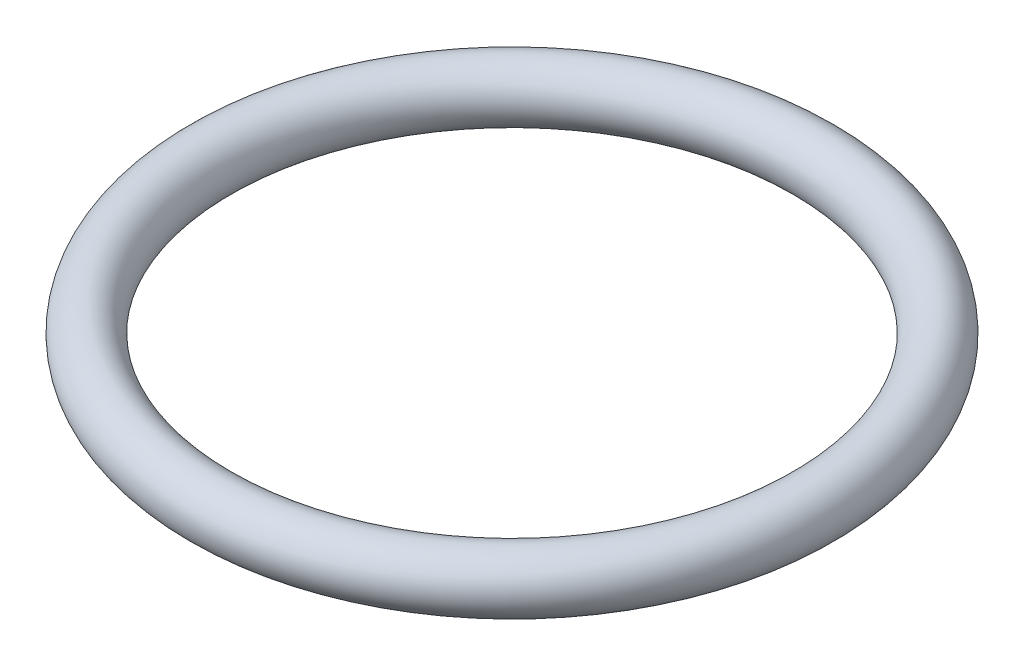
ISO-10303-21;
HEADER;
FILE_DESCRIPTION(('STEP AP214'),'2;1');
FILE_NAME('part.step','',(''),(''),'','','');
FILE_SCHEMA(('AUTOMOTIVE_DESIGN { 1 0 10303 214 1 1 1 1 }'));
ENDSEC;
DATA;
#1=APPLICATION_CONTEXT('core data for automotive mechanical design processes');
#2=APPLICATION_PROTOCOL_DEFINITION('international standard','automotive_design',2000,#1);
#3=PRODUCT_CONTEXT('',#1,'mechanical');
#4=PRODUCT('Part','Part','',(#3));
#5=PRODUCT_RELATED_PRODUCT_CATEGORY('part','',(#4));
#6=PRODUCT_DEFINITION_FORMATION('','',#4);
#7=PRODUCT_DEFINITION_CONTEXT('part definition',#1,'design');
#8=PRODUCT_DEFINITION('design','',#6,#7);
#9=PRODUCT_DEFINITION_SHAPE('','',#8);
#10=(LENGTH_UNIT() NAMED_UNIT(*) SI_UNIT(.MILLI.,.METRE.));
#11=(NAMED_UNIT(*) PLANE_ANGLE_UNIT() SI_UNIT($,.RADIAN.));
#12=(NAMED_UNIT(*) SI_UNIT($,.STERADIAN.) SOLID_ANGLE_UNIT());
#13=UNCERTAINTY_MEASURE_WITH_UNIT(LENGTH_MEASURE(1.E-05),#10,'distance_accuracy_value','');
#14=(GEOMETRIC_REPRESENTATION_CONTEXT(3) GLOBAL_UNCERTAINTY_ASSIGNED_CONTEXT((#13)) GLOBAL_UNIT_ASSIGNED_CONTEXT((#10,
#11,#12)) REPRESENTATION_CONTEXT('',''));
#15=CARTESIAN_POINT('',(0.,0.,0.));
#16=DIRECTION('',(0.,0.,1.));
#17=DIRECTION('',(1.,0.,0.));
#18=AXIS2_PLACEMENT_3D('',#15,#16,#17);
#19=CARTESIAN_POINT('',(0.,0.,0.));
#20=DIRECTION('',(0.,1.,0.));
#21=DIRECTION('',(0.,0.,1.));
#22=AXIS2_PLACEMENT_3D('',#19,#20,#21);
#23=TOROIDAL_SURFACE('',#22,13.81,1.31);
#24=CARTESIAN_POINT('',(0.,0.,15.12));
#25=VERTEX_POINT('',#24);
#26=VERTEX_LOOP('',#25);
#27=FACE_BOUND('',#26,.T.);
#28=ADVANCED_FACE('F30',(#27),#23,.T.);
#29=CLOSED_SHELL('',(#28));
#30=MANIFOLD_SOLID_BREP('B2',#29);
#31=ADVANCED_BREP_SHAPE_REPRESENTATION('',(#18,#30),#14);
#32=SHAPE_DEFINITION_REPRESENTATION(#9,#31);
ENDSEC;
END-ISO-10303-21;
